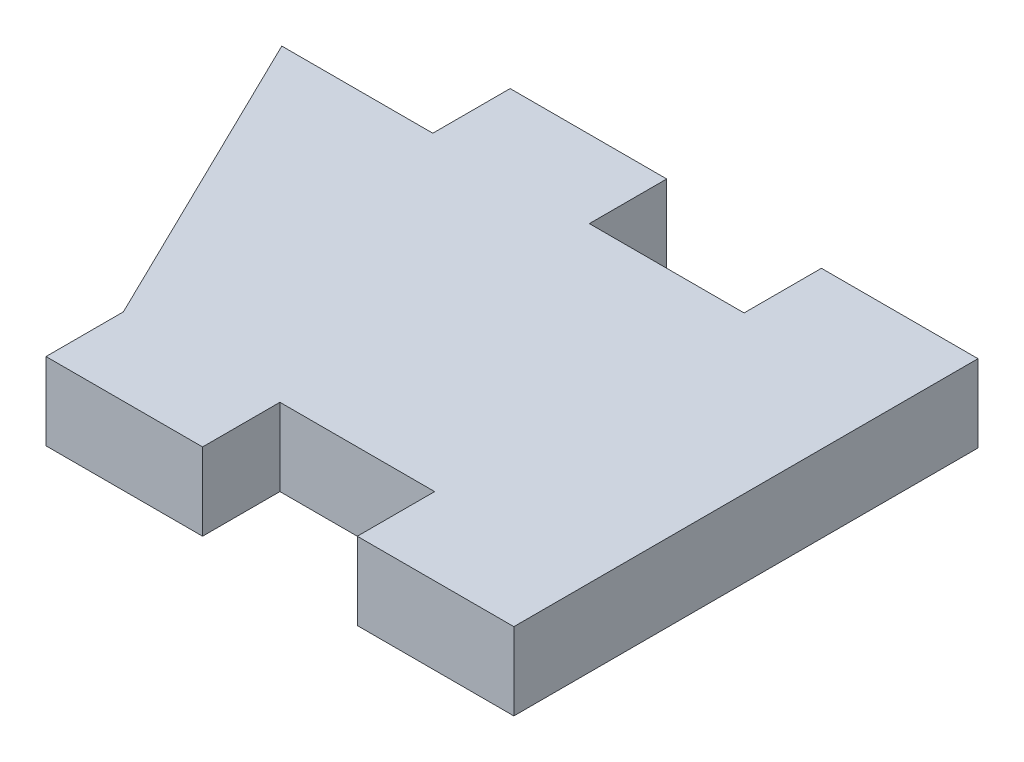
ISO-10303-21;
HEADER;
FILE_DESCRIPTION(('STEP AP214'),'2;1');
FILE_NAME('part.step','',(''),(''),'','','');
FILE_SCHEMA(('AUTOMOTIVE_DESIGN { 1 0 10303 214 1 1 1 1 }'));
ENDSEC;
DATA;
#1=APPLICATION_CONTEXT('core data for automotive mechanical design processes');
#2=APPLICATION_PROTOCOL_DEFINITION('international standard','automotive_design',2000,#1);
#3=PRODUCT_CONTEXT('',#1,'mechanical');
#4=PRODUCT('Part','Part','',(#3));
#5=PRODUCT_RELATED_PRODUCT_CATEGORY('part','',(#4));
#6=PRODUCT_DEFINITION_FORMATION('','',#4);
#7=PRODUCT_DEFINITION_CONTEXT('part definition',#1,'design');
#8=PRODUCT_DEFINITION('design','',#6,#7);
#9=PRODUCT_DEFINITION_SHAPE('','',#8);
#10=(LENGTH_UNIT() NAMED_UNIT(*) SI_UNIT(.MILLI.,.METRE.));
#11=(NAMED_UNIT(*) PLANE_ANGLE_UNIT() SI_UNIT($,.RADIAN.));
#12=(NAMED_UNIT(*) SI_UNIT($,.STERADIAN.) SOLID_ANGLE_UNIT());
#13=UNCERTAINTY_MEASURE_WITH_UNIT(LENGTH_MEASURE(1.E-05),#10,'distance_accuracy_value','');
#14=(GEOMETRIC_REPRESENTATION_CONTEXT(3) GLOBAL_UNCERTAINTY_ASSIGNED_CONTEXT((#13)) GLOBAL_UNIT_ASSIGNED_CONTEXT((#10,
#11,#12)) REPRESENTATION_CONTEXT('',''));
#15=CARTESIAN_POINT('',(0.,0.,0.));
#16=DIRECTION('',(0.,0.,1.));
#17=DIRECTION('',(1.,0.,0.));
#18=AXIS2_PLACEMENT_3D('',#15,#16,#17);
#19=CARTESIAN_POINT('',(-12.7,3.175,-6.35));
#20=DIRECTION('',(0.,0.,1.));
#21=DIRECTION('',(1.,0.,0.));
#22=AXIS2_PLACEMENT_3D('',#19,#20,#21);
#23=PLANE('',#22);
#24=DIRECTION('',(-1.,0.,0.));
#25=VECTOR('',#24,1.);
#26=CARTESIAN_POINT('',(-12.7,0.,-6.35));
#27=LINE('',#26,#25);
#28=CARTESIAN_POINT('',(6.2738,0.,-6.35));
#29=VERTEX_POINT('',#28);
#30=CARTESIAN_POINT('',(-0.0761999999999968,0.,-6.35));
#31=VERTEX_POINT('',#30);
#32=EDGE_CURVE('E172',#29,#31,#27,.T.);
#33=ORIENTED_EDGE('',*,*,#32,.T.);
#34=DIRECTION('',(0.,1.,0.));
#35=VECTOR('',#34,1.);
#36=CARTESIAN_POINT('',(-0.0761999999999968,3.175,-6.35));
#37=LINE('',#36,#35);
#38=CARTESIAN_POINT('',(-0.0761999999999968,3.175,-6.35));
#39=VERTEX_POINT('',#38);
#40=EDGE_CURVE('E67',#31,#39,#37,.T.);
#41=ORIENTED_EDGE('',*,*,#40,.T.);
#42=DIRECTION('',(-1.,0.,0.));
#43=VECTOR('',#42,1.);
#44=CARTESIAN_POINT('',(-12.7,3.175,-6.35));
#45=LINE('',#44,#43);
#46=CARTESIAN_POINT('',(6.2738,3.175,-6.35));
#47=VERTEX_POINT('',#46);
#48=EDGE_CURVE('E52',#47,#39,#45,.T.);
#49=ORIENTED_EDGE('',*,*,#48,.F.);
#50=DIRECTION('',(0.,-1.,0.));
#51=VECTOR('',#50,1.);
#52=CARTESIAN_POINT('',(6.2738,3.175,-6.35));
#53=LINE('',#52,#51);
#54=EDGE_CURVE('E256',#47,#29,#53,.T.);
#55=ORIENTED_EDGE('',*,*,#54,.T.);
#56=EDGE_LOOP('',(#33,#41,#49,#55));
#57=FACE_BOUND('',#56,.T.);
#58=ADVANCED_FACE('F43',(#57),#23,.F.);
#59=CARTESIAN_POINT('',(-12.7,3.175,6.35));
#60=DIRECTION('',(0.,0.,-1.));
#61=DIRECTION('',(-1.,0.,0.));
#62=AXIS2_PLACEMENT_3D('',#59,#60,#61);
#63=PLANE('',#62);
#64=DIRECTION('',(0.,1.,0.));
#65=VECTOR('',#64,1.);
#66=CARTESIAN_POINT('',(-0.0761999999999968,3.175,6.35));
#67=LINE('',#66,#65);
#68=CARTESIAN_POINT('',(-0.0761999999999964,0.,6.35));
#69=VERTEX_POINT('',#68);
#70=CARTESIAN_POINT('',(-0.0761999999999968,3.175,6.35));
#71=VERTEX_POINT('',#70);
#72=EDGE_CURVE('E203',#69,#71,#67,.T.);
#73=ORIENTED_EDGE('',*,*,#72,.F.);
#74=DIRECTION('',(1.,0.,0.));
#75=VECTOR('',#74,1.);
#76=CARTESIAN_POINT('',(-12.7,0.,6.35));
#77=LINE('',#76,#75);
#78=CARTESIAN_POINT('',(6.2738,0.,6.35));
#79=VERTEX_POINT('',#78);
#80=EDGE_CURVE('E177',#69,#79,#77,.T.);
#81=ORIENTED_EDGE('',*,*,#80,.T.);
#82=DIRECTION('',(0.,-1.,0.));
#83=VECTOR('',#82,1.);
#84=CARTESIAN_POINT('',(6.2738,3.175,6.35));
#85=LINE('',#84,#83);
#86=CARTESIAN_POINT('',(6.2738,3.175,6.35));
#87=VERTEX_POINT('',#86);
#88=EDGE_CURVE('E198',#87,#79,#85,.T.);
#89=ORIENTED_EDGE('',*,*,#88,.F.);
#90=DIRECTION('',(1.,0.,0.));
#91=VECTOR('',#90,1.);
#92=CARTESIAN_POINT('',(-12.7,3.175,6.35));
#93=LINE('',#92,#91);
#94=EDGE_CURVE('E176',#71,#87,#93,.T.);
#95=ORIENTED_EDGE('',*,*,#94,.F.);
#96=EDGE_LOOP('',(#73,#81,#89,#95));
#97=FACE_BOUND('',#96,.T.);
#98=ADVANCED_FACE('F45',(#97),#63,.F.);
#99=CARTESIAN_POINT('',(12.7,3.175,-6.35));
#100=DIRECTION('',(-1.,0.,0.));
#101=DIRECTION('',(0.,0.,1.));
#102=AXIS2_PLACEMENT_3D('',#99,#100,#101);
#103=PLANE('',#102);
#104=DIRECTION('',(0.,0.,-1.));
#105=VECTOR('',#104,1.);
#106=CARTESIAN_POINT('',(12.7,0.,-6.35));
#107=LINE('',#106,#105);
#108=CARTESIAN_POINT('',(12.7,0.,9.525));
#109=VERTEX_POINT('',#108);
#110=CARTESIAN_POINT('',(12.7,0.,-9.525));
#111=VERTEX_POINT('',#110);
#112=EDGE_CURVE('E173',#109,#111,#107,.T.);
#113=ORIENTED_EDGE('',*,*,#112,.T.);
#114=DIRECTION('',(0.,1.,0.));
#115=VECTOR('',#114,1.);
#116=CARTESIAN_POINT('',(12.7,3.175,-9.525));
#117=LINE('',#116,#115);
#118=CARTESIAN_POINT('',(12.7,3.175,-9.525));
#119=VERTEX_POINT('',#118);
#120=EDGE_CURVE('E260',#111,#119,#117,.T.);
#121=ORIENTED_EDGE('',*,*,#120,.T.);
#122=DIRECTION('',(0.,0.,-1.));
#123=VECTOR('',#122,1.);
#124=CARTESIAN_POINT('',(12.7,3.175,-6.35));
#125=LINE('',#124,#123);
#126=CARTESIAN_POINT('',(12.7,3.175,9.525));
#127=VERTEX_POINT('',#126);
#128=EDGE_CURVE('E185',#127,#119,#125,.T.);
#129=ORIENTED_EDGE('',*,*,#128,.F.);
#130=DIRECTION('',(0.,1.,0.));
#131=VECTOR('',#130,1.);
#132=CARTESIAN_POINT('',(12.7,3.175,9.525));
#133=LINE('',#132,#131);
#134=EDGE_CURVE('E202',#109,#127,#133,.T.);
#135=ORIENTED_EDGE('',*,*,#134,.F.);
#136=EDGE_LOOP('',(#113,#121,#129,#135));
#137=FACE_BOUND('',#136,.T.);
#138=ADVANCED_FACE('F340',(#137),#103,.F.);
#139=CARTESIAN_POINT('',(-6.5024,3.175,-6.35));
#140=VERTEX_POINT('',#139);
#141=CARTESIAN_POINT('',(-12.7,3.175,-6.35));
#142=VERTEX_POINT('',#141);
#143=EDGE_CURVE('E59',#140,#142,#45,.T.);
#144=ORIENTED_EDGE('',*,*,#143,.F.);
#145=DIRECTION('',(0.,-1.,0.));
#146=VECTOR('',#145,1.);
#147=CARTESIAN_POINT('',(-6.5024,3.175,-6.35));
#148=LINE('',#147,#146);
#149=CARTESIAN_POINT('',(-6.5024,0.,-6.35));
#150=VERTEX_POINT('',#149);
#151=EDGE_CURVE('E169',#140,#150,#148,.T.);
#152=ORIENTED_EDGE('',*,*,#151,.T.);
#153=CARTESIAN_POINT('',(-12.7,0.,-6.35));
#154=VERTEX_POINT('',#153);
#155=EDGE_CURVE('E161',#150,#154,#27,.T.);
#156=ORIENTED_EDGE('',*,*,#155,.T.);
#157=DIRECTION('',(0.,-1.,0.));
#158=VECTOR('',#157,1.);
#159=CARTESIAN_POINT('',(-12.7,3.175,-6.35));
#160=LINE('',#159,#158);
#161=EDGE_CURVE('E11',#142,#154,#160,.T.);
#162=ORIENTED_EDGE('',*,*,#161,.F.);
#163=EDGE_LOOP('',(#144,#152,#156,#162));
#164=FACE_BOUND('',#163,.T.);
#165=ADVANCED_FACE('F167',(#164),#23,.F.);
#166=CARTESIAN_POINT('',(0.,3.175,0.));
#167=DIRECTION('',(0.,1.,0.));
#168=DIRECTION('',(0.,0.,1.));
#169=AXIS2_PLACEMENT_3D('',#166,#167,#168);
#170=PLANE('',#169);
#171=DIRECTION('',(-0.43856527644785,0.,-0.898699336983299));
#172=VECTOR('',#171,1.);
#173=CARTESIAN_POINT('',(-6.5024,3.175,6.35));
#174=LINE('',#173,#172);
#175=CARTESIAN_POINT('',(-6.5024,3.175,6.35));
#176=VERTEX_POINT('',#175);
#177=EDGE_CURVE('E156',#176,#142,#174,.T.);
#178=ORIENTED_EDGE('',*,*,#177,.F.);
#179=DIRECTION('',(0.,0.,-1.));
#180=VECTOR('',#179,1.);
#181=CARTESIAN_POINT('',(-6.5024,3.175,9.525));
#182=LINE('',#181,#180);
#183=CARTESIAN_POINT('',(-6.5024,3.175,9.525));
#184=VERTEX_POINT('',#183);
#185=EDGE_CURVE('E241',#184,#176,#182,.T.);
#186=ORIENTED_EDGE('',*,*,#185,.F.);
#187=DIRECTION('',(-1.,0.,0.));
#188=VECTOR('',#187,1.);
#189=CARTESIAN_POINT('',(-0.0761999999999968,3.175,9.525));
#190=LINE('',#189,#188);
#191=CARTESIAN_POINT('',(-0.0761999999999968,3.175,9.525));
#192=VERTEX_POINT('',#191);
#193=EDGE_CURVE('E221',#192,#184,#190,.T.);
#194=ORIENTED_EDGE('',*,*,#193,.F.);
#195=DIRECTION('',(0.,0.,-1.));
#196=VECTOR('',#195,1.);
#197=CARTESIAN_POINT('',(-0.0761999999999968,3.175,9.525));
#198=LINE('',#197,#196);
#199=EDGE_CURVE('E245',#192,#71,#198,.T.);
#200=ORIENTED_EDGE('',*,*,#199,.T.);
#201=ORIENTED_EDGE('',*,*,#94,.T.);
#202=DIRECTION('',(0.,0.,-1.));
#203=VECTOR('',#202,1.);
#204=CARTESIAN_POINT('',(6.2738,3.175,9.525));
#205=LINE('',#204,#203);
#206=CARTESIAN_POINT('',(6.2738,3.175,9.525));
#207=VERTEX_POINT('',#206);
#208=EDGE_CURVE('E182',#207,#87,#205,.T.);
#209=ORIENTED_EDGE('',*,*,#208,.F.);
#210=DIRECTION('',(-1.,0.,0.));
#211=VECTOR('',#210,1.);
#212=CARTESIAN_POINT('',(12.7,3.175,9.525));
#213=LINE('',#212,#211);
#214=EDGE_CURVE('E210',#127,#207,#213,.T.);
#215=ORIENTED_EDGE('',*,*,#214,.F.);
#216=ORIENTED_EDGE('',*,*,#128,.T.);
#217=DIRECTION('',(-1.,0.,0.));
#218=VECTOR('',#217,1.);
#219=CARTESIAN_POINT('',(12.7,3.175,-9.525));
#220=LINE('',#219,#218);
#221=CARTESIAN_POINT('',(6.2738,3.175,-9.525));
#222=VERTEX_POINT('',#221);
#223=EDGE_CURVE('E255',#119,#222,#220,.T.);
#224=ORIENTED_EDGE('',*,*,#223,.T.);
#225=DIRECTION('',(0.,0.,1.));
#226=VECTOR('',#225,1.);
#227=CARTESIAN_POINT('',(6.2738,3.175,-9.525));
#228=LINE('',#227,#226);
#229=EDGE_CURVE('E252',#222,#47,#228,.T.);
#230=ORIENTED_EDGE('',*,*,#229,.T.);
#231=ORIENTED_EDGE('',*,*,#48,.T.);
#232=DIRECTION('',(0.,0.,1.));
#233=VECTOR('',#232,1.);
#234=CARTESIAN_POINT('',(-0.0761999999999968,3.175,-9.525));
#235=LINE('',#234,#233);
#236=CARTESIAN_POINT('',(-0.0761999999999968,3.175,-9.525));
#237=VERTEX_POINT('',#236);
#238=EDGE_CURVE('E285',#237,#39,#235,.T.);
#239=ORIENTED_EDGE('',*,*,#238,.F.);
#240=DIRECTION('',(-1.,0.,0.));
#241=VECTOR('',#240,1.);
#242=CARTESIAN_POINT('',(-0.0761999999999968,3.175,-9.525));
#243=LINE('',#242,#241);
#244=CARTESIAN_POINT('',(-6.5024,3.175,-9.525));
#245=VERTEX_POINT('',#244);
#246=EDGE_CURVE('E289',#237,#245,#243,.T.);
#247=ORIENTED_EDGE('',*,*,#246,.T.);
#248=DIRECTION('',(0.,0.,1.));
#249=VECTOR('',#248,1.);
#250=CARTESIAN_POINT('',(-6.5024,3.175,-9.525));
#251=LINE('',#250,#249);
#252=EDGE_CURVE('E282',#245,#140,#251,.T.);
#253=ORIENTED_EDGE('',*,*,#252,.T.);
#254=ORIENTED_EDGE('',*,*,#143,.T.);
#255=EDGE_LOOP('',(#178,#186,#194,#200,#201,#209,#215,#216,#224,#230,#231,#239,#247,#253,#254));
#256=FACE_BOUND('',#255,.T.);
#257=ADVANCED_FACE('F319',(#256),#170,.T.);
#258=CARTESIAN_POINT('',(0.,0.,0.));
#259=DIRECTION('',(0.,1.,0.));
#260=DIRECTION('',(0.,0.,1.));
#261=AXIS2_PLACEMENT_3D('',#258,#259,#260);
#262=PLANE('',#261);
#263=DIRECTION('',(0.,0.,-1.));
#264=VECTOR('',#263,1.);
#265=CARTESIAN_POINT('',(-6.5024,0.,9.525));
#266=LINE('',#265,#264);
#267=CARTESIAN_POINT('',(-6.5024,0.,9.525));
#268=VERTEX_POINT('',#267);
#269=CARTESIAN_POINT('',(-6.5024,0.,6.35));
#270=VERTEX_POINT('',#269);
#271=EDGE_CURVE('E164',#268,#270,#266,.T.);
#272=ORIENTED_EDGE('',*,*,#271,.T.);
#273=DIRECTION('',(-0.43856527644785,0.,-0.898699336983299));
#274=VECTOR('',#273,1.);
#275=CARTESIAN_POINT('',(-6.5024,0.,6.35));
#276=LINE('',#275,#274);
#277=EDGE_CURVE('E153',#270,#154,#276,.T.);
#278=ORIENTED_EDGE('',*,*,#277,.T.);
#279=ORIENTED_EDGE('',*,*,#155,.F.);
#280=DIRECTION('',(0.,0.,1.));
#281=VECTOR('',#280,1.);
#282=CARTESIAN_POINT('',(-6.5024,0.,-9.525));
#283=LINE('',#282,#281);
#284=CARTESIAN_POINT('',(-6.5024,0.,-9.525));
#285=VERTEX_POINT('',#284);
#286=EDGE_CURVE('E279',#285,#150,#283,.T.);
#287=ORIENTED_EDGE('',*,*,#286,.F.);
#288=DIRECTION('',(1.,0.,0.));
#289=VECTOR('',#288,1.);
#290=CARTESIAN_POINT('',(-0.0761999999999964,0.,-9.525));
#291=LINE('',#290,#289);
#292=CARTESIAN_POINT('',(-0.0761999999999964,0.,-9.525));
#293=VERTEX_POINT('',#292);
#294=EDGE_CURVE('E302',#285,#293,#291,.T.);
#295=ORIENTED_EDGE('',*,*,#294,.T.);
#296=DIRECTION('',(0.,0.,1.));
#297=VECTOR('',#296,1.);
#298=CARTESIAN_POINT('',(-0.0761999999999964,0.,-9.525));
#299=LINE('',#298,#297);
#300=EDGE_CURVE('E261',#293,#31,#299,.T.);
#301=ORIENTED_EDGE('',*,*,#300,.T.);
#302=ORIENTED_EDGE('',*,*,#32,.F.);
#303=DIRECTION('',(0.,0.,1.));
#304=VECTOR('',#303,1.);
#305=CARTESIAN_POINT('',(6.2738,0.,-9.525));
#306=LINE('',#305,#304);
#307=CARTESIAN_POINT('',(6.2738,0.,-9.525));
#308=VERTEX_POINT('',#307);
#309=EDGE_CURVE('E249',#308,#29,#306,.T.);
#310=ORIENTED_EDGE('',*,*,#309,.F.);
#311=DIRECTION('',(1.,0.,0.));
#312=VECTOR('',#311,1.);
#313=CARTESIAN_POINT('',(12.7,0.,-9.525));
#314=LINE('',#313,#312);
#315=EDGE_CURVE('E269',#308,#111,#314,.T.);
#316=ORIENTED_EDGE('',*,*,#315,.T.);
#317=ORIENTED_EDGE('',*,*,#112,.F.);
#318=DIRECTION('',(1.,0.,0.));
#319=VECTOR('',#318,1.);
#320=CARTESIAN_POINT('',(12.7,0.,9.525));
#321=LINE('',#320,#319);
#322=CARTESIAN_POINT('',(6.2738,0.,9.525));
#323=VERTEX_POINT('',#322);
#324=EDGE_CURVE('E197',#323,#109,#321,.T.);
#325=ORIENTED_EDGE('',*,*,#324,.F.);
#326=DIRECTION('',(0.,0.,-1.));
#327=VECTOR('',#326,1.);
#328=CARTESIAN_POINT('',(6.2738,0.,9.525));
#329=LINE('',#328,#327);
#330=EDGE_CURVE('E193',#323,#79,#329,.T.);
#331=ORIENTED_EDGE('',*,*,#330,.T.);
#332=ORIENTED_EDGE('',*,*,#80,.F.);
#333=DIRECTION('',(0.,0.,-1.));
#334=VECTOR('',#333,1.);
#335=CARTESIAN_POINT('',(-0.0761999999999964,0.,9.525));
#336=LINE('',#335,#334);
#337=CARTESIAN_POINT('',(-0.0761999999999964,0.,9.525));
#338=VERTEX_POINT('',#337);
#339=EDGE_CURVE('E230',#338,#69,#336,.T.);
#340=ORIENTED_EDGE('',*,*,#339,.F.);
#341=DIRECTION('',(1.,0.,0.));
#342=VECTOR('',#341,1.);
#343=CARTESIAN_POINT('',(-0.0761999999999964,0.,9.525));
#344=LINE('',#343,#342);
#345=EDGE_CURVE('E227',#268,#338,#344,.T.);
#346=ORIENTED_EDGE('',*,*,#345,.F.);
#347=EDGE_LOOP('',(#272,#278,#279,#287,#295,#301,#302,#310,#316,#317,#325,#331,#332,#340,#346));
#348=FACE_BOUND('',#347,.T.);
#349=ADVANCED_FACE('F160',(#348),#262,.F.);
#350=CARTESIAN_POINT('',(6.2738,3.175,9.525));
#351=DIRECTION('',(1.,0.,0.));
#352=DIRECTION('',(0.,0.,-1.));
#353=AXIS2_PLACEMENT_3D('',#350,#351,#352);
#354=PLANE('',#353);
#355=ORIENTED_EDGE('',*,*,#88,.T.);
#356=ORIENTED_EDGE('',*,*,#330,.F.);
#357=DIRECTION('',(0.,-1.,0.));
#358=VECTOR('',#357,1.);
#359=CARTESIAN_POINT('',(6.2738,3.175,9.525));
#360=LINE('',#359,#358);
#361=EDGE_CURVE('E207',#207,#323,#360,.T.);
#362=ORIENTED_EDGE('',*,*,#361,.F.);
#363=ORIENTED_EDGE('',*,*,#208,.T.);
#364=EDGE_LOOP('',(#355,#356,#362,#363));
#365=FACE_BOUND('',#364,.T.);
#366=ADVANCED_FACE('F367',(#365),#354,.F.);
#367=CARTESIAN_POINT('',(0.,0.,9.525));
#368=DIRECTION('',(0.,0.,-1.));
#369=DIRECTION('',(-1.,0.,0.));
#370=AXIS2_PLACEMENT_3D('',#367,#368,#369);
#371=PLANE('',#370);
#372=ORIENTED_EDGE('',*,*,#134,.T.);
#373=ORIENTED_EDGE('',*,*,#214,.T.);
#374=ORIENTED_EDGE('',*,*,#361,.T.);
#375=ORIENTED_EDGE('',*,*,#324,.T.);
#376=EDGE_LOOP('',(#372,#373,#374,#375));
#377=FACE_BOUND('',#376,.T.);
#378=ADVANCED_FACE('F362',(#377),#371,.F.);
#379=CARTESIAN_POINT('',(-0.0761999999999968,3.175,9.525));
#380=DIRECTION('',(-1.,0.,0.));
#381=DIRECTION('',(0.,-1.,0.));
#382=AXIS2_PLACEMENT_3D('',#379,#380,#381);
#383=PLANE('',#382);
#384=ORIENTED_EDGE('',*,*,#72,.T.);
#385=ORIENTED_EDGE('',*,*,#199,.F.);
#386=DIRECTION('',(0.,1.,0.));
#387=VECTOR('',#386,1.);
#388=CARTESIAN_POINT('',(-0.0761999999999968,3.175,9.525));
#389=LINE('',#388,#387);
#390=EDGE_CURVE('E216',#338,#192,#389,.T.);
#391=ORIENTED_EDGE('',*,*,#390,.F.);
#392=ORIENTED_EDGE('',*,*,#339,.T.);
#393=EDGE_LOOP('',(#384,#385,#391,#392));
#394=FACE_BOUND('',#393,.T.);
#395=ADVANCED_FACE('F372',(#394),#383,.F.);
#396=CARTESIAN_POINT('',(-6.5024,3.175,9.525));
#397=DIRECTION('',(1.,0.,0.));
#398=DIRECTION('',(0.,1.,0.));
#399=AXIS2_PLACEMENT_3D('',#396,#397,#398);
#400=PLANE('',#399);
#401=DIRECTION('',(0.,-1.,0.));
#402=VECTOR('',#401,1.);
#403=CARTESIAN_POINT('',(-6.5024,3.175,6.35));
#404=LINE('',#403,#402);
#405=EDGE_CURVE('E220',#176,#270,#404,.T.);
#406=ORIENTED_EDGE('',*,*,#405,.T.);
#407=ORIENTED_EDGE('',*,*,#271,.F.);
#408=DIRECTION('',(0.,-1.,0.));
#409=VECTOR('',#408,1.);
#410=CARTESIAN_POINT('',(-6.5024,3.175,9.525));
#411=LINE('',#410,#409);
#412=EDGE_CURVE('E224',#184,#268,#411,.T.);
#413=ORIENTED_EDGE('',*,*,#412,.F.);
#414=ORIENTED_EDGE('',*,*,#185,.T.);
#415=EDGE_LOOP('',(#406,#407,#413,#414));
#416=FACE_BOUND('',#415,.T.);
#417=ADVANCED_FACE('F378',(#416),#400,.F.);
#418=CARTESIAN_POINT('',(0.,0.,9.525));
#419=DIRECTION('',(0.,0.,-1.));
#420=DIRECTION('',(-1.,0.,0.));
#421=AXIS2_PLACEMENT_3D('',#418,#419,#420);
#422=PLANE('',#421);
#423=ORIENTED_EDGE('',*,*,#390,.T.);
#424=ORIENTED_EDGE('',*,*,#193,.T.);
#425=ORIENTED_EDGE('',*,*,#412,.T.);
#426=ORIENTED_EDGE('',*,*,#345,.T.);
#427=EDGE_LOOP('',(#423,#424,#425,#426));
#428=FACE_BOUND('',#427,.T.);
#429=ADVANCED_FACE('F374',(#428),#422,.F.);
#430=CARTESIAN_POINT('',(6.2738,3.175,-9.525));
#431=DIRECTION('',(-1.,0.,0.));
#432=DIRECTION('',(0.,0.,1.));
#433=AXIS2_PLACEMENT_3D('',#430,#431,#432);
#434=PLANE('',#433);
#435=ORIENTED_EDGE('',*,*,#54,.F.);
#436=ORIENTED_EDGE('',*,*,#229,.F.);
#437=DIRECTION('',(0.,-1.,0.));
#438=VECTOR('',#437,1.);
#439=CARTESIAN_POINT('',(6.2738,3.175,-9.525));
#440=LINE('',#439,#438);
#441=EDGE_CURVE('E265',#222,#308,#440,.T.);
#442=ORIENTED_EDGE('',*,*,#441,.T.);
#443=ORIENTED_EDGE('',*,*,#309,.T.);
#444=EDGE_LOOP('',(#435,#436,#442,#443));
#445=FACE_BOUND('',#444,.T.);
#446=ADVANCED_FACE('F386',(#445),#434,.T.);
#447=CARTESIAN_POINT('',(0.,0.,-9.525));
#448=DIRECTION('',(0.,0.,1.));
#449=DIRECTION('',(-1.,0.,0.));
#450=AXIS2_PLACEMENT_3D('',#447,#448,#449);
#451=PLANE('',#450);
#452=ORIENTED_EDGE('',*,*,#120,.F.);
#453=ORIENTED_EDGE('',*,*,#315,.F.);
#454=ORIENTED_EDGE('',*,*,#441,.F.);
#455=ORIENTED_EDGE('',*,*,#223,.F.);
#456=EDGE_LOOP('',(#452,#453,#454,#455));
#457=FACE_BOUND('',#456,.T.);
#458=ADVANCED_FACE('F333',(#457),#451,.F.);
#459=CARTESIAN_POINT('',(-0.0761999999999968,3.175,-9.525));
#460=DIRECTION('',(1.,0.,0.));
#461=DIRECTION('',(0.,1.,0.));
#462=AXIS2_PLACEMENT_3D('',#459,#460,#461);
#463=PLANE('',#462);
#464=ORIENTED_EDGE('',*,*,#40,.F.);
#465=ORIENTED_EDGE('',*,*,#300,.F.);
#466=DIRECTION('',(0.,1.,0.));
#467=VECTOR('',#466,1.);
#468=CARTESIAN_POINT('',(-0.0761999999999968,3.175,-9.525));
#469=LINE('',#468,#467);
#470=EDGE_CURVE('E292',#293,#237,#469,.T.);
#471=ORIENTED_EDGE('',*,*,#470,.T.);
#472=ORIENTED_EDGE('',*,*,#238,.T.);
#473=EDGE_LOOP('',(#464,#465,#471,#472));
#474=FACE_BOUND('',#473,.T.);
#475=ADVANCED_FACE('F313',(#474),#463,.T.);
#476=CARTESIAN_POINT('',(-6.5024,3.175,-9.525));
#477=DIRECTION('',(-1.,0.,0.));
#478=DIRECTION('',(0.,-1.,0.));
#479=AXIS2_PLACEMENT_3D('',#476,#477,#478);
#480=PLANE('',#479);
#481=ORIENTED_EDGE('',*,*,#151,.F.);
#482=ORIENTED_EDGE('',*,*,#252,.F.);
#483=DIRECTION('',(0.,-1.,0.));
#484=VECTOR('',#483,1.);
#485=CARTESIAN_POINT('',(-6.5024,3.175,-9.525));
#486=LINE('',#485,#484);
#487=EDGE_CURVE('E298',#245,#285,#486,.T.);
#488=ORIENTED_EDGE('',*,*,#487,.T.);
#489=ORIENTED_EDGE('',*,*,#286,.T.);
#490=EDGE_LOOP('',(#481,#482,#488,#489));
#491=FACE_BOUND('',#490,.T.);
#492=ADVANCED_FACE('F325',(#491),#480,.T.);
#493=CARTESIAN_POINT('',(0.,0.,-9.525));
#494=DIRECTION('',(0.,0.,1.));
#495=DIRECTION('',(-1.,0.,0.));
#496=AXIS2_PLACEMENT_3D('',#493,#494,#495);
#497=PLANE('',#496);
#498=ORIENTED_EDGE('',*,*,#470,.F.);
#499=ORIENTED_EDGE('',*,*,#294,.F.);
#500=ORIENTED_EDGE('',*,*,#487,.F.);
#501=ORIENTED_EDGE('',*,*,#246,.F.);
#502=EDGE_LOOP('',(#498,#499,#500,#501));
#503=FACE_BOUND('',#502,.T.);
#504=ADVANCED_FACE('F317',(#503),#497,.F.);
#505=CARTESIAN_POINT('',(-6.5024,0.,6.35));
#506=DIRECTION('',(0.898699336983299,0.,-0.43856527644785));
#507=DIRECTION('',(-0.43856527644785,0.,-0.898699336983299));
#508=AXIS2_PLACEMENT_3D('',#505,#506,#507);
#509=PLANE('',#508);
#510=ORIENTED_EDGE('',*,*,#177,.T.);
#511=ORIENTED_EDGE('',*,*,#161,.T.);
#512=ORIENTED_EDGE('',*,*,#277,.F.);
#513=ORIENTED_EDGE('',*,*,#405,.F.);
#514=EDGE_LOOP('',(#510,#511,#512,#513));
#515=FACE_BOUND('',#514,.T.);
#516=ADVANCED_FACE('F152',(#515),#509,.F.);
#517=CLOSED_SHELL('',(#58,#98,#138,#165,#257,#349,#366,#378,#395,#417,#429,#446,#458,#475,#492,
#504,#516));
#518=MANIFOLD_SOLID_BREP('B2',#517);
#519=ADVANCED_BREP_SHAPE_REPRESENTATION('',(#18,#518),#14);
#520=SHAPE_DEFINITION_REPRESENTATION(#9,#519);
ENDSEC;
END-ISO-10303-21;
